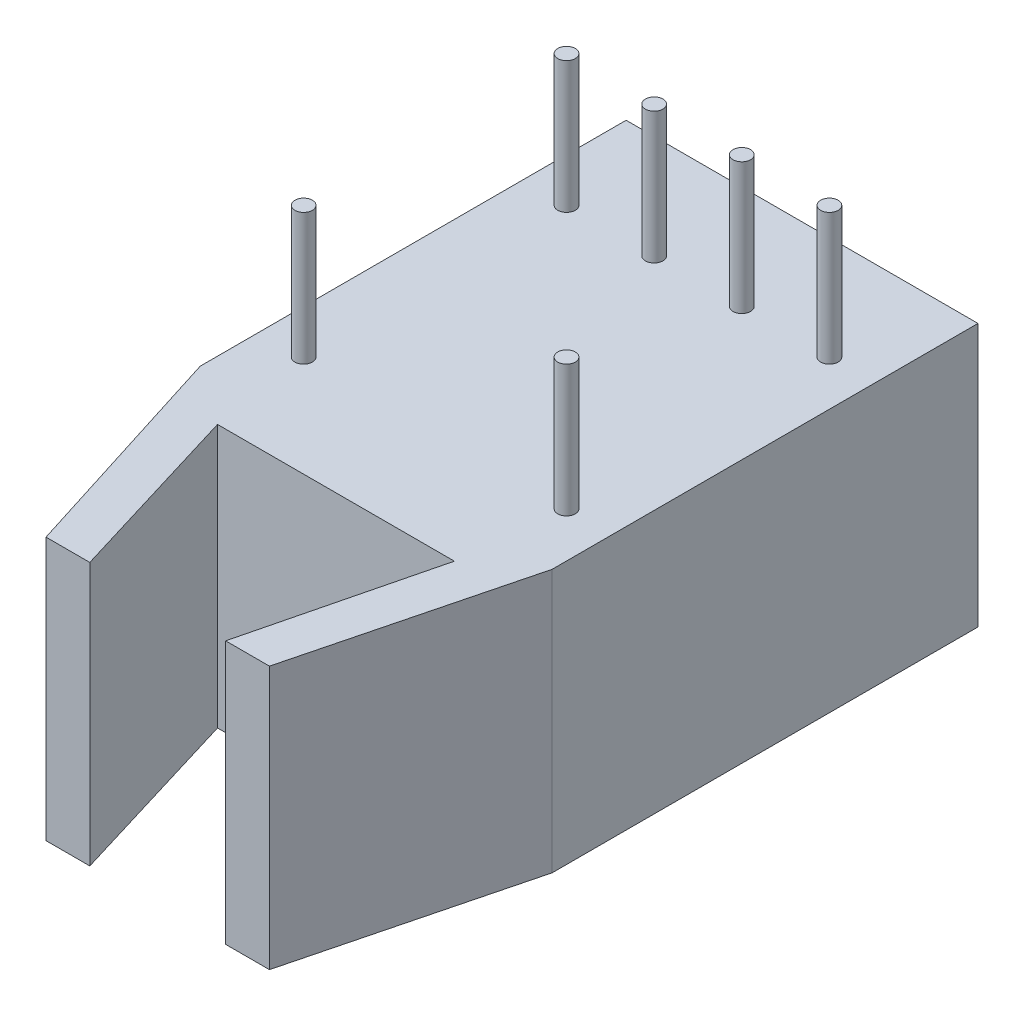
ISO-10303-21;
HEADER;
FILE_DESCRIPTION(('STEP AP214'),'2;1');
FILE_NAME('part.step','',(''),(''),'','','');
FILE_SCHEMA(('AUTOMOTIVE_DESIGN { 1 0 10303 214 1 1 1 1 }'));
ENDSEC;
DATA;
#1=APPLICATION_CONTEXT('core data for automotive mechanical design processes');
#2=APPLICATION_PROTOCOL_DEFINITION('international standard','automotive_design',2000,#1);
#3=PRODUCT_CONTEXT('',#1,'mechanical');
#4=PRODUCT('Part','Part','',(#3));
#5=PRODUCT_RELATED_PRODUCT_CATEGORY('part','',(#4));
#6=PRODUCT_DEFINITION_FORMATION('','',#4);
#7=PRODUCT_DEFINITION_CONTEXT('part definition',#1,'design');
#8=PRODUCT_DEFINITION('design','',#6,#7);
#9=PRODUCT_DEFINITION_SHAPE('','',#8);
#10=(LENGTH_UNIT() NAMED_UNIT(*) SI_UNIT(.MILLI.,.METRE.));
#11=(NAMED_UNIT(*) PLANE_ANGLE_UNIT() SI_UNIT($,.RADIAN.));
#12=(NAMED_UNIT(*) SI_UNIT($,.STERADIAN.) SOLID_ANGLE_UNIT());
#13=UNCERTAINTY_MEASURE_WITH_UNIT(LENGTH_MEASURE(1.E-05),#10,'distance_accuracy_value','');
#14=(GEOMETRIC_REPRESENTATION_CONTEXT(3) GLOBAL_UNCERTAINTY_ASSIGNED_CONTEXT((#13)) GLOBAL_UNIT_ASSIGNED_CONTEXT((#10,
#11,#12)) REPRESENTATION_CONTEXT('',''));
#15=CARTESIAN_POINT('',(0.,0.,0.));
#16=DIRECTION('',(0.,0.,1.));
#17=DIRECTION('',(1.,0.,0.));
#18=AXIS2_PLACEMENT_3D('',#15,#16,#17);
#19=CARTESIAN_POINT('',(0.,7.62,0.));
#20=DIRECTION('',(0.,1.,0.));
#21=DIRECTION('',(0.,0.,1.));
#22=AXIS2_PLACEMENT_3D('',#19,#20,#21);
#23=PLANE('',#22);
#24=CARTESIAN_POINT('',(1.27,7.62,2.9972));
#25=DIRECTION('',(0.,1.,0.));
#26=DIRECTION('',(0.,0.,1.));
#27=AXIS2_PLACEMENT_3D('',#24,#25,#26);
#28=CIRCLE('',#27,0.254);
#29=CARTESIAN_POINT('',(1.27,7.62,3.2512));
#30=VERTEX_POINT('',#29);
#31=EDGE_CURVE('E130',#30,#30,#28,.T.);
#32=ORIENTED_EDGE('',*,*,#31,.F.);
#33=EDGE_LOOP('',(#32));
#34=FACE_BOUND('',#33,.T.);
#35=DIRECTION('',(0.,0.,1.));
#36=VECTOR('',#35,1.);
#37=CARTESIAN_POINT('',(0.,7.62,0.));
#38=LINE('',#37,#36);
#39=CARTESIAN_POINT('',(0.,7.62,0.));
#40=VERTEX_POINT('',#39);
#41=CARTESIAN_POINT('',(0.,7.62,12.3444));
#42=VERTEX_POINT('',#41);
#43=EDGE_CURVE('E125',#40,#42,#38,.T.);
#44=ORIENTED_EDGE('',*,*,#43,.T.);
#45=DIRECTION('',(0.300509046787398,0.,0.953778964330274));
#46=VECTOR('',#45,1.);
#47=CARTESIAN_POINT('',(0.,7.62,12.3444));
#48=LINE('',#47,#46);
#49=CARTESIAN_POINT('',(2.05672700801933,7.62,18.8722));
#50=VERTEX_POINT('',#49);
#51=EDGE_CURVE('E107',#42,#50,#48,.T.);
#52=ORIENTED_EDGE('',*,*,#51,.T.);
#53=DIRECTION('',(1.,0.,0.));
#54=VECTOR('',#53,1.);
#55=CARTESIAN_POINT('',(2.05672700801933,7.62,18.8722));
#56=LINE('',#55,#54);
#57=CARTESIAN_POINT('',(3.32672700801933,7.62,18.8722));
#58=VERTEX_POINT('',#57);
#59=EDGE_CURVE('E117',#50,#58,#56,.T.);
#60=ORIENTED_EDGE('',*,*,#59,.T.);
#61=DIRECTION('',(-0.290411816615932,0.,-0.95690175920511));
#62=VECTOR('',#61,1.);
#63=CARTESIAN_POINT('',(3.32672700801933,7.62,18.8722));
#64=LINE('',#63,#62);
#65=CARTESIAN_POINT('',(1.71375929008197,7.62,13.5575001202891));
#66=VERTEX_POINT('',#65);
#67=EDGE_CURVE('E121',#58,#66,#64,.T.);
#68=ORIENTED_EDGE('',*,*,#67,.T.);
#69=DIRECTION('',(1.,0.,0.));
#70=VECTOR('',#69,1.);
#71=CARTESIAN_POINT('',(1.71375929008197,7.62,13.5575001202891));
#72=LINE('',#71,#70);
#73=CARTESIAN_POINT('',(8.57962491547872,7.62,13.5575001202891));
#74=VERTEX_POINT('',#73);
#75=EDGE_CURVE('E135',#66,#74,#72,.T.);
#76=ORIENTED_EDGE('',*,*,#75,.T.);
#77=DIRECTION('',(-0.240338643663703,0.,0.970689103864822));
#78=VECTOR('',#77,1.);
#79=CARTESIAN_POINT('',(8.57962491547872,7.62,13.5575001202891));
#80=LINE('',#79,#78);
#81=CARTESIAN_POINT('',(7.26372700801933,7.62,18.8722));
#82=VERTEX_POINT('',#81);
#83=EDGE_CURVE('E138',#74,#82,#80,.T.);
#84=ORIENTED_EDGE('',*,*,#83,.T.);
#85=DIRECTION('',(1.,0.,0.));
#86=VECTOR('',#85,1.);
#87=CARTESIAN_POINT('',(7.26372700801933,7.62,18.8722));
#88=LINE('',#87,#86);
#89=CARTESIAN_POINT('',(8.53372700801933,7.62,18.8722));
#90=VERTEX_POINT('',#89);
#91=EDGE_CURVE('E141',#82,#90,#88,.T.);
#92=ORIENTED_EDGE('',*,*,#91,.T.);
#93=DIRECTION('',(0.247327596518511,0.,-0.968931917113053));
#94=VECTOR('',#93,1.);
#95=CARTESIAN_POINT('',(8.53372700801933,7.62,18.8722));
#96=LINE('',#95,#94);
#97=CARTESIAN_POINT('',(10.2,7.62,12.3444));
#98=VERTEX_POINT('',#97);
#99=EDGE_CURVE('E144',#90,#98,#96,.T.);
#100=ORIENTED_EDGE('',*,*,#99,.T.);
#101=DIRECTION('',(0.,0.,-1.));
#102=VECTOR('',#101,1.);
#103=CARTESIAN_POINT('',(10.2,7.62,0.));
#104=LINE('',#103,#102);
#105=CARTESIAN_POINT('',(10.2,7.62,0.));
#106=VERTEX_POINT('',#105);
#107=EDGE_CURVE('E46',#98,#106,#104,.T.);
#108=ORIENTED_EDGE('',*,*,#107,.T.);
#109=DIRECTION('',(-1.,0.,0.));
#110=VECTOR('',#109,1.);
#111=CARTESIAN_POINT('',(0.,7.62,0.));
#112=LINE('',#111,#110);
#113=EDGE_CURVE('E41',#106,#40,#112,.T.);
#114=ORIENTED_EDGE('',*,*,#113,.T.);
#115=EDGE_LOOP('',(#44,#52,#60,#68,#76,#84,#92,#100,#108,#114));
#116=FACE_BOUND('',#115,.T.);
#117=CARTESIAN_POINT('',(3.81,7.62,2.9972));
#118=DIRECTION('',(0.,1.,0.));
#119=DIRECTION('',(0.,0.,1.));
#120=AXIS2_PLACEMENT_3D('',#117,#118,#119);
#121=CIRCLE('',#120,0.254);
#122=CARTESIAN_POINT('',(3.81,7.62,3.2512));
#123=VERTEX_POINT('',#122);
#124=EDGE_CURVE('E420',#123,#123,#121,.T.);
#125=ORIENTED_EDGE('',*,*,#124,.F.);
#126=EDGE_LOOP('',(#125));
#127=FACE_BOUND('',#126,.T.);
#128=CARTESIAN_POINT('',(6.35,7.62,2.9972));
#129=DIRECTION('',(0.,1.,0.));
#130=DIRECTION('',(0.,0.,1.));
#131=AXIS2_PLACEMENT_3D('',#128,#129,#130);
#132=CIRCLE('',#131,0.254);
#133=CARTESIAN_POINT('',(6.35,7.62,3.2512));
#134=VERTEX_POINT('',#133);
#135=EDGE_CURVE('E191',#134,#134,#132,.T.);
#136=ORIENTED_EDGE('',*,*,#135,.F.);
#137=EDGE_LOOP('',(#136));
#138=FACE_BOUND('',#137,.T.);
#139=CARTESIAN_POINT('',(8.89,7.62,2.9972));
#140=DIRECTION('',(0.,1.,0.));
#141=DIRECTION('',(0.,0.,1.));
#142=AXIS2_PLACEMENT_3D('',#139,#140,#141);
#143=CIRCLE('',#142,0.254);
#144=CARTESIAN_POINT('',(8.89,7.62,3.2512));
#145=VERTEX_POINT('',#144);
#146=EDGE_CURVE('E197',#145,#145,#143,.T.);
#147=ORIENTED_EDGE('',*,*,#146,.F.);
#148=EDGE_LOOP('',(#147));
#149=FACE_BOUND('',#148,.T.);
#150=CARTESIAN_POINT('',(1.27,7.62,10.6172));
#151=DIRECTION('',(0.,1.,0.));
#152=DIRECTION('',(0.,0.,1.));
#153=AXIS2_PLACEMENT_3D('',#150,#151,#152);
#154=CIRCLE('',#153,0.254);
#155=CARTESIAN_POINT('',(1.27,7.62,10.8712));
#156=VERTEX_POINT('',#155);
#157=EDGE_CURVE('E203',#156,#156,#154,.T.);
#158=ORIENTED_EDGE('',*,*,#157,.F.);
#159=EDGE_LOOP('',(#158));
#160=FACE_BOUND('',#159,.T.);
#161=CARTESIAN_POINT('',(8.89,7.62,10.6172));
#162=DIRECTION('',(0.,1.,0.));
#163=DIRECTION('',(0.,0.,1.));
#164=AXIS2_PLACEMENT_3D('',#161,#162,#163);
#165=CIRCLE('',#164,0.254);
#166=CARTESIAN_POINT('',(8.89,7.62,10.8712));
#167=VERTEX_POINT('',#166);
#168=EDGE_CURVE('E34',#167,#167,#165,.T.);
#169=ORIENTED_EDGE('',*,*,#168,.F.);
#170=EDGE_LOOP('',(#169));
#171=FACE_BOUND('',#170,.T.);
#172=ADVANCED_FACE('F26',(#34,#116,#127,#138,#149,#160,#171),#23,.T.);
#173=CARTESIAN_POINT('',(0.,7.62,0.));
#174=DIRECTION('',(1.,0.,0.));
#175=DIRECTION('',(0.,0.,-1.));
#176=AXIS2_PLACEMENT_3D('',#173,#174,#175);
#177=PLANE('',#176);
#178=DIRECTION('',(0.,0.,1.));
#179=VECTOR('',#178,1.);
#180=CARTESIAN_POINT('',(0.,0.,0.));
#181=LINE('',#180,#179);
#182=CARTESIAN_POINT('',(0.,0.,0.));
#183=VERTEX_POINT('',#182);
#184=CARTESIAN_POINT('',(0.,0.,12.3444));
#185=VERTEX_POINT('',#184);
#186=EDGE_CURVE('E165',#183,#185,#181,.T.);
#187=ORIENTED_EDGE('',*,*,#186,.T.);
#188=DIRECTION('',(0.,-1.,0.));
#189=VECTOR('',#188,1.);
#190=CARTESIAN_POINT('',(0.,7.62,12.3444));
#191=LINE('',#190,#189);
#192=EDGE_CURVE('E189',#42,#185,#191,.T.);
#193=ORIENTED_EDGE('',*,*,#192,.F.);
#194=ORIENTED_EDGE('',*,*,#43,.F.);
#195=DIRECTION('',(0.,-1.,0.));
#196=VECTOR('',#195,1.);
#197=CARTESIAN_POINT('',(0.,7.62,0.));
#198=LINE('',#197,#196);
#199=EDGE_CURVE('E181',#40,#183,#198,.T.);
#200=ORIENTED_EDGE('',*,*,#199,.T.);
#201=EDGE_LOOP('',(#187,#193,#194,#200));
#202=FACE_BOUND('',#201,.T.);
#203=ADVANCED_FACE('F214',(#202),#177,.F.);
#204=CARTESIAN_POINT('',(10.2,7.62,0.));
#205=DIRECTION('',(-1.,0.,0.));
#206=DIRECTION('',(0.,0.,1.));
#207=AXIS2_PLACEMENT_3D('',#204,#205,#206);
#208=PLANE('',#207);
#209=DIRECTION('',(0.,0.,-1.));
#210=VECTOR('',#209,1.);
#211=CARTESIAN_POINT('',(10.2,0.,0.));
#212=LINE('',#211,#210);
#213=CARTESIAN_POINT('',(10.2,0.,12.3444));
#214=VERTEX_POINT('',#213);
#215=CARTESIAN_POINT('',(10.2,0.,0.));
#216=VERTEX_POINT('',#215);
#217=EDGE_CURVE('E174',#214,#216,#212,.T.);
#218=ORIENTED_EDGE('',*,*,#217,.T.);
#219=DIRECTION('',(0.,-1.,0.));
#220=VECTOR('',#219,1.);
#221=CARTESIAN_POINT('',(10.2,7.62,0.));
#222=LINE('',#221,#220);
#223=EDGE_CURVE('E184',#106,#216,#222,.T.);
#224=ORIENTED_EDGE('',*,*,#223,.F.);
#225=ORIENTED_EDGE('',*,*,#107,.F.);
#226=DIRECTION('',(0.,-1.,0.));
#227=VECTOR('',#226,1.);
#228=CARTESIAN_POINT('',(10.2,7.62,12.3444));
#229=LINE('',#228,#227);
#230=EDGE_CURVE('E187',#98,#214,#229,.T.);
#231=ORIENTED_EDGE('',*,*,#230,.T.);
#232=EDGE_LOOP('',(#218,#224,#225,#231));
#233=FACE_BOUND('',#232,.T.);
#234=ADVANCED_FACE('F222',(#233),#208,.F.);
#235=CARTESIAN_POINT('',(0.,7.62,0.));
#236=DIRECTION('',(0.,0.,1.));
#237=DIRECTION('',(1.,0.,0.));
#238=AXIS2_PLACEMENT_3D('',#235,#236,#237);
#239=PLANE('',#238);
#240=DIRECTION('',(-1.,0.,0.));
#241=VECTOR('',#240,1.);
#242=CARTESIAN_POINT('',(0.,0.,0.));
#243=LINE('',#242,#241);
#244=EDGE_CURVE('E176',#216,#183,#243,.T.);
#245=ORIENTED_EDGE('',*,*,#244,.T.);
#246=ORIENTED_EDGE('',*,*,#199,.F.);
#247=ORIENTED_EDGE('',*,*,#113,.F.);
#248=ORIENTED_EDGE('',*,*,#223,.T.);
#249=EDGE_LOOP('',(#245,#246,#247,#248));
#250=FACE_BOUND('',#249,.T.);
#251=ADVANCED_FACE('F230',(#250),#239,.F.);
#252=CARTESIAN_POINT('',(0.,0.,0.));
#253=DIRECTION('',(0.,1.,0.));
#254=DIRECTION('',(0.,0.,1.));
#255=AXIS2_PLACEMENT_3D('',#252,#253,#254);
#256=PLANE('',#255);
#257=ORIENTED_EDGE('',*,*,#186,.F.);
#258=ORIENTED_EDGE('',*,*,#244,.F.);
#259=ORIENTED_EDGE('',*,*,#217,.F.);
#260=DIRECTION('',(0.247327596518511,0.,-0.968931917113053));
#261=VECTOR('',#260,1.);
#262=CARTESIAN_POINT('',(8.53372700801933,0.,18.8722));
#263=LINE('',#262,#261);
#264=CARTESIAN_POINT('',(8.53372700801933,0.,18.8722));
#265=VERTEX_POINT('',#264);
#266=EDGE_CURVE('E114',#265,#214,#263,.T.);
#267=ORIENTED_EDGE('',*,*,#266,.F.);
#268=DIRECTION('',(1.,0.,0.));
#269=VECTOR('',#268,1.);
#270=CARTESIAN_POINT('',(7.26372700801933,0.,18.8722));
#271=LINE('',#270,#269);
#272=CARTESIAN_POINT('',(7.26372700801933,0.,18.8722));
#273=VERTEX_POINT('',#272);
#274=EDGE_CURVE('E158',#273,#265,#271,.T.);
#275=ORIENTED_EDGE('',*,*,#274,.F.);
#276=DIRECTION('',(-0.240338643663703,0.,0.970689103864822));
#277=VECTOR('',#276,1.);
#278=CARTESIAN_POINT('',(8.57962491547872,0.,13.5575001202891));
#279=LINE('',#278,#277);
#280=CARTESIAN_POINT('',(8.57962491547872,0.,13.5575001202891));
#281=VERTEX_POINT('',#280);
#282=EDGE_CURVE('E155',#281,#273,#279,.T.);
#283=ORIENTED_EDGE('',*,*,#282,.F.);
#284=DIRECTION('',(1.,0.,0.));
#285=VECTOR('',#284,1.);
#286=CARTESIAN_POINT('',(1.71375929008197,0.,13.5575001202891));
#287=LINE('',#286,#285);
#288=CARTESIAN_POINT('',(1.71375929008197,0.,13.5575001202891));
#289=VERTEX_POINT('',#288);
#290=EDGE_CURVE('E152',#289,#281,#287,.T.);
#291=ORIENTED_EDGE('',*,*,#290,.F.);
#292=DIRECTION('',(-0.290411816615932,0.,-0.95690175920511));
#293=VECTOR('',#292,1.);
#294=CARTESIAN_POINT('',(3.32672700801933,0.,18.8722));
#295=LINE('',#294,#293);
#296=CARTESIAN_POINT('',(3.32672700801933,0.,18.8722));
#297=VERTEX_POINT('',#296);
#298=EDGE_CURVE('E149',#297,#289,#295,.T.);
#299=ORIENTED_EDGE('',*,*,#298,.F.);
#300=DIRECTION('',(1.,0.,0.));
#301=VECTOR('',#300,1.);
#302=CARTESIAN_POINT('',(2.05672700801933,0.,18.8722));
#303=LINE('',#302,#301);
#304=CARTESIAN_POINT('',(2.05672700801933,0.,18.8722));
#305=VERTEX_POINT('',#304);
#306=EDGE_CURVE('E147',#305,#297,#303,.T.);
#307=ORIENTED_EDGE('',*,*,#306,.F.);
#308=DIRECTION('',(0.300509046787398,0.,0.953778964330274));
#309=VECTOR('',#308,1.);
#310=CARTESIAN_POINT('',(0.,0.,12.3444));
#311=LINE('',#310,#309);
#312=EDGE_CURVE('E109',#185,#305,#311,.T.);
#313=ORIENTED_EDGE('',*,*,#312,.F.);
#314=EDGE_LOOP('',(#257,#258,#259,#267,#275,#283,#291,#299,#307,#313));
#315=FACE_BOUND('',#314,.T.);
#316=ADVANCED_FACE('F228',(#315),#256,.F.);
#317=CARTESIAN_POINT('',(8.53372700801933,0.,18.8722));
#318=DIRECTION('',(0.968931917113053,0.,0.247327596518511));
#319=DIRECTION('',(0.247327596518511,0.,-0.968931917113053));
#320=AXIS2_PLACEMENT_3D('',#317,#318,#319);
#321=PLANE('',#320);
#322=ORIENTED_EDGE('',*,*,#99,.F.);
#323=DIRECTION('',(0.,1.,0.));
#324=VECTOR('',#323,1.);
#325=CARTESIAN_POINT('',(8.53372700801933,0.,18.8722));
#326=LINE('',#325,#324);
#327=EDGE_CURVE('E163',#265,#90,#326,.T.);
#328=ORIENTED_EDGE('',*,*,#327,.F.);
#329=ORIENTED_EDGE('',*,*,#266,.T.);
#330=ORIENTED_EDGE('',*,*,#230,.F.);
#331=EDGE_LOOP('',(#322,#328,#329,#330));
#332=FACE_BOUND('',#331,.T.);
#333=ADVANCED_FACE('F371',(#332),#321,.T.);
#334=CARTESIAN_POINT('',(7.26372700801933,0.,18.8722));
#335=DIRECTION('',(0.,0.,1.));
#336=DIRECTION('',(1.,0.,0.));
#337=AXIS2_PLACEMENT_3D('',#334,#335,#336);
#338=PLANE('',#337);
#339=ORIENTED_EDGE('',*,*,#91,.F.);
#340=DIRECTION('',(0.,1.,0.));
#341=VECTOR('',#340,1.);
#342=CARTESIAN_POINT('',(7.26372700801933,0.,18.8722));
#343=LINE('',#342,#341);
#344=EDGE_CURVE('E166',#273,#82,#343,.T.);
#345=ORIENTED_EDGE('',*,*,#344,.F.);
#346=ORIENTED_EDGE('',*,*,#274,.T.);
#347=ORIENTED_EDGE('',*,*,#327,.T.);
#348=EDGE_LOOP('',(#339,#345,#346,#347));
#349=FACE_BOUND('',#348,.T.);
#350=ADVANCED_FACE('F363',(#349),#338,.T.);
#351=CARTESIAN_POINT('',(8.57962491547872,0.,13.5575001202891));
#352=DIRECTION('',(-0.970689103864822,0.,-0.240338643663703));
#353=DIRECTION('',(-0.240338643663703,0.,0.970689103864822));
#354=AXIS2_PLACEMENT_3D('',#351,#352,#353);
#355=PLANE('',#354);
#356=ORIENTED_EDGE('',*,*,#83,.F.);
#357=DIRECTION('',(0.,1.,0.));
#358=VECTOR('',#357,1.);
#359=CARTESIAN_POINT('',(8.57962491547872,0.,13.5575001202891));
#360=LINE('',#359,#358);
#361=EDGE_CURVE('E168',#281,#74,#360,.T.);
#362=ORIENTED_EDGE('',*,*,#361,.F.);
#363=ORIENTED_EDGE('',*,*,#282,.T.);
#364=ORIENTED_EDGE('',*,*,#344,.T.);
#365=EDGE_LOOP('',(#356,#362,#363,#364));
#366=FACE_BOUND('',#365,.T.);
#367=ADVANCED_FACE('F355',(#366),#355,.T.);
#368=CARTESIAN_POINT('',(1.71375929008197,0.,13.5575001202891));
#369=DIRECTION('',(0.,0.,1.));
#370=DIRECTION('',(1.,0.,0.));
#371=AXIS2_PLACEMENT_3D('',#368,#369,#370);
#372=PLANE('',#371);
#373=ORIENTED_EDGE('',*,*,#75,.F.);
#374=DIRECTION('',(0.,1.,0.));
#375=VECTOR('',#374,1.);
#376=CARTESIAN_POINT('',(1.71375929008197,0.,13.5575001202891));
#377=LINE('',#376,#375);
#378=EDGE_CURVE('E170',#289,#66,#377,.T.);
#379=ORIENTED_EDGE('',*,*,#378,.F.);
#380=ORIENTED_EDGE('',*,*,#290,.T.);
#381=ORIENTED_EDGE('',*,*,#361,.T.);
#382=EDGE_LOOP('',(#373,#379,#380,#381));
#383=FACE_BOUND('',#382,.T.);
#384=ADVANCED_FACE('F347',(#383),#372,.T.);
#385=CARTESIAN_POINT('',(3.32672700801933,0.,18.8722));
#386=DIRECTION('',(0.95690175920511,0.,-0.290411816615932));
#387=DIRECTION('',(-0.290411816615932,0.,-0.95690175920511));
#388=AXIS2_PLACEMENT_3D('',#385,#386,#387);
#389=PLANE('',#388);
#390=ORIENTED_EDGE('',*,*,#67,.F.);
#391=DIRECTION('',(0.,1.,0.));
#392=VECTOR('',#391,1.);
#393=CARTESIAN_POINT('',(3.32672700801933,0.,18.8722));
#394=LINE('',#393,#392);
#395=EDGE_CURVE('E113',#297,#58,#394,.T.);
#396=ORIENTED_EDGE('',*,*,#395,.F.);
#397=ORIENTED_EDGE('',*,*,#298,.T.);
#398=ORIENTED_EDGE('',*,*,#378,.T.);
#399=EDGE_LOOP('',(#390,#396,#397,#398));
#400=FACE_BOUND('',#399,.T.);
#401=ADVANCED_FACE('F340',(#400),#389,.T.);
#402=CARTESIAN_POINT('',(2.05672700801933,0.,18.8722));
#403=DIRECTION('',(0.,0.,1.));
#404=DIRECTION('',(1.,0.,0.));
#405=AXIS2_PLACEMENT_3D('',#402,#403,#404);
#406=PLANE('',#405);
#407=ORIENTED_EDGE('',*,*,#59,.F.);
#408=DIRECTION('',(0.,1.,0.));
#409=VECTOR('',#408,1.);
#410=CARTESIAN_POINT('',(2.05672700801933,0.,18.8722));
#411=LINE('',#410,#409);
#412=EDGE_CURVE('E102',#305,#50,#411,.T.);
#413=ORIENTED_EDGE('',*,*,#412,.F.);
#414=ORIENTED_EDGE('',*,*,#306,.T.);
#415=ORIENTED_EDGE('',*,*,#395,.T.);
#416=EDGE_LOOP('',(#407,#413,#414,#415));
#417=FACE_BOUND('',#416,.T.);
#418=ADVANCED_FACE('F118',(#417),#406,.T.);
#419=CARTESIAN_POINT('',(0.,0.,12.3444));
#420=DIRECTION('',(-0.953778964330274,0.,0.300509046787398));
#421=DIRECTION('',(0.300509046787398,0.,0.953778964330274));
#422=AXIS2_PLACEMENT_3D('',#419,#420,#421);
#423=PLANE('',#422);
#424=ORIENTED_EDGE('',*,*,#51,.F.);
#425=ORIENTED_EDGE('',*,*,#192,.T.);
#426=ORIENTED_EDGE('',*,*,#312,.T.);
#427=ORIENTED_EDGE('',*,*,#412,.T.);
#428=EDGE_LOOP('',(#424,#425,#426,#427));
#429=FACE_BOUND('',#428,.T.);
#430=ADVANCED_FACE('F104',(#429),#423,.T.);
#431=CARTESIAN_POINT('',(1.27,11.43,2.9972));
#432=DIRECTION('',(0.,-1.,0.));
#433=DIRECTION('',(0.,0.,-1.));
#434=AXIS2_PLACEMENT_3D('',#431,#432,#433);
#435=CYLINDRICAL_SURFACE('',#434,0.254);
#436=CARTESIAN_POINT('',(1.27,11.43,2.9972));
#437=DIRECTION('',(0.,1.,0.));
#438=DIRECTION('',(0.,0.,1.));
#439=AXIS2_PLACEMENT_3D('',#436,#437,#438);
#440=CIRCLE('',#439,0.254);
#441=CARTESIAN_POINT('',(1.27,11.43,3.2512));
#442=VERTEX_POINT('',#441);
#443=EDGE_CURVE('E127',#442,#442,#440,.T.);
#444=ORIENTED_EDGE('',*,*,#443,.F.);
#445=EDGE_LOOP('',(#444));
#446=FACE_BOUND('',#445,.T.);
#447=ORIENTED_EDGE('',*,*,#31,.T.);
#448=EDGE_LOOP('',(#447));
#449=FACE_BOUND('',#448,.T.);
#450=ADVANCED_FACE('F320',(#446,#449),#435,.T.);
#451=CARTESIAN_POINT('',(1.27,11.43,2.9972));
#452=DIRECTION('',(0.,1.,0.));
#453=DIRECTION('',(0.,0.,1.));
#454=AXIS2_PLACEMENT_3D('',#451,#452,#453);
#455=PLANE('',#454);
#456=ORIENTED_EDGE('',*,*,#443,.T.);
#457=EDGE_LOOP('',(#456));
#458=FACE_BOUND('',#457,.T.);
#459=ADVANCED_FACE('F302',(#458),#455,.T.);
#460=CARTESIAN_POINT('',(3.81,11.43,2.9972));
#461=DIRECTION('',(0.,-1.,0.));
#462=DIRECTION('',(0.,0.,-1.));
#463=AXIS2_PLACEMENT_3D('',#460,#461,#462);
#464=CYLINDRICAL_SURFACE('',#463,0.254);
#465=CARTESIAN_POINT('',(3.81,11.43,2.9972));
#466=DIRECTION('',(0.,1.,0.));
#467=DIRECTION('',(0.,0.,1.));
#468=AXIS2_PLACEMENT_3D('',#465,#466,#467);
#469=CIRCLE('',#468,0.254);
#470=CARTESIAN_POINT('',(3.81,11.43,3.2512));
#471=VERTEX_POINT('',#470);
#472=EDGE_CURVE('E418',#471,#471,#469,.T.);
#473=ORIENTED_EDGE('',*,*,#472,.F.);
#474=EDGE_LOOP('',(#473));
#475=FACE_BOUND('',#474,.T.);
#476=ORIENTED_EDGE('',*,*,#124,.T.);
#477=EDGE_LOOP('',(#476));
#478=FACE_BOUND('',#477,.T.);
#479=ADVANCED_FACE('F247',(#475,#478),#464,.T.);
#480=CARTESIAN_POINT('',(3.81,11.43,2.9972));
#481=DIRECTION('',(0.,1.,0.));
#482=DIRECTION('',(0.,0.,1.));
#483=AXIS2_PLACEMENT_3D('',#480,#481,#482);
#484=PLANE('',#483);
#485=ORIENTED_EDGE('',*,*,#472,.T.);
#486=EDGE_LOOP('',(#485));
#487=FACE_BOUND('',#486,.T.);
#488=ADVANCED_FACE('F245',(#487),#484,.T.);
#489=CARTESIAN_POINT('',(6.35,11.43,2.9972));
#490=DIRECTION('',(0.,1.,0.));
#491=DIRECTION('',(0.,0.,1.));
#492=AXIS2_PLACEMENT_3D('',#489,#490,#491);
#493=PLANE('',#492);
#494=CARTESIAN_POINT('',(6.35,11.43,2.9972));
#495=DIRECTION('',(0.,1.,0.));
#496=DIRECTION('',(0.,0.,1.));
#497=AXIS2_PLACEMENT_3D('',#494,#495,#496);
#498=CIRCLE('',#497,0.254);
#499=CARTESIAN_POINT('',(6.35,11.43,3.2512));
#500=VERTEX_POINT('',#499);
#501=EDGE_CURVE('E194',#500,#500,#498,.T.);
#502=ORIENTED_EDGE('',*,*,#501,.T.);
#503=EDGE_LOOP('',(#502));
#504=FACE_BOUND('',#503,.T.);
#505=ADVANCED_FACE('F241',(#504),#493,.T.);
#506=CARTESIAN_POINT('',(6.35,11.43,2.9972));
#507=DIRECTION('',(0.,-1.,0.));
#508=DIRECTION('',(0.,0.,-1.));
#509=AXIS2_PLACEMENT_3D('',#506,#507,#508);
#510=CYLINDRICAL_SURFACE('',#509,0.254);
#511=ORIENTED_EDGE('',*,*,#501,.F.);
#512=EDGE_LOOP('',(#511));
#513=FACE_BOUND('',#512,.T.);
#514=ORIENTED_EDGE('',*,*,#135,.T.);
#515=EDGE_LOOP('',(#514));
#516=FACE_BOUND('',#515,.T.);
#517=ADVANCED_FACE('F237',(#513,#516),#510,.T.);
#518=CARTESIAN_POINT('',(8.89,11.43,2.9972));
#519=DIRECTION('',(0.,1.,0.));
#520=DIRECTION('',(0.,0.,1.));
#521=AXIS2_PLACEMENT_3D('',#518,#519,#520);
#522=PLANE('',#521);
#523=CARTESIAN_POINT('',(8.89,11.43,2.9972));
#524=DIRECTION('',(0.,1.,0.));
#525=DIRECTION('',(0.,0.,1.));
#526=AXIS2_PLACEMENT_3D('',#523,#524,#525);
#527=CIRCLE('',#526,0.254);
#528=CARTESIAN_POINT('',(8.89,11.43,3.2512));
#529=VERTEX_POINT('',#528);
#530=EDGE_CURVE('E200',#529,#529,#527,.T.);
#531=ORIENTED_EDGE('',*,*,#530,.T.);
#532=EDGE_LOOP('',(#531));
#533=FACE_BOUND('',#532,.T.);
#534=ADVANCED_FACE('F240',(#533),#522,.T.);
#535=CARTESIAN_POINT('',(8.89,11.43,2.9972));
#536=DIRECTION('',(0.,-1.,0.));
#537=DIRECTION('',(0.,0.,-1.));
#538=AXIS2_PLACEMENT_3D('',#535,#536,#537);
#539=CYLINDRICAL_SURFACE('',#538,0.254);
#540=ORIENTED_EDGE('',*,*,#530,.F.);
#541=EDGE_LOOP('',(#540));
#542=FACE_BOUND('',#541,.T.);
#543=ORIENTED_EDGE('',*,*,#146,.T.);
#544=EDGE_LOOP('',(#543));
#545=FACE_BOUND('',#544,.T.);
#546=ADVANCED_FACE('F248',(#542,#545),#539,.T.);
#547=CARTESIAN_POINT('',(1.27,11.43,10.6172));
#548=DIRECTION('',(0.,1.,0.));
#549=DIRECTION('',(0.,0.,1.));
#550=AXIS2_PLACEMENT_3D('',#547,#548,#549);
#551=PLANE('',#550);
#552=CARTESIAN_POINT('',(1.27,11.43,10.6172));
#553=DIRECTION('',(0.,1.,0.));
#554=DIRECTION('',(0.,0.,1.));
#555=AXIS2_PLACEMENT_3D('',#552,#553,#554);
#556=CIRCLE('',#555,0.254);
#557=CARTESIAN_POINT('',(1.27,11.43,10.8712));
#558=VERTEX_POINT('',#557);
#559=EDGE_CURVE('E206',#558,#558,#556,.T.);
#560=ORIENTED_EDGE('',*,*,#559,.T.);
#561=EDGE_LOOP('',(#560));
#562=FACE_BOUND('',#561,.T.);
#563=ADVANCED_FACE('F251',(#562),#551,.T.);
#564=CARTESIAN_POINT('',(1.27,11.43,10.6172));
#565=DIRECTION('',(0.,-1.,0.));
#566=DIRECTION('',(0.,0.,-1.));
#567=AXIS2_PLACEMENT_3D('',#564,#565,#566);
#568=CYLINDRICAL_SURFACE('',#567,0.254);
#569=ORIENTED_EDGE('',*,*,#559,.F.);
#570=EDGE_LOOP('',(#569));
#571=FACE_BOUND('',#570,.T.);
#572=ORIENTED_EDGE('',*,*,#157,.T.);
#573=EDGE_LOOP('',(#572));
#574=FACE_BOUND('',#573,.T.);
#575=ADVANCED_FACE('F256',(#571,#574),#568,.T.);
#576=CARTESIAN_POINT('',(8.89,11.43,10.6172));
#577=DIRECTION('',(0.,1.,0.));
#578=DIRECTION('',(0.,0.,1.));
#579=AXIS2_PLACEMENT_3D('',#576,#577,#578);
#580=PLANE('',#579);
#581=CARTESIAN_POINT('',(8.89,11.43,10.6172));
#582=DIRECTION('',(0.,1.,0.));
#583=DIRECTION('',(0.,0.,1.));
#584=AXIS2_PLACEMENT_3D('',#581,#582,#583);
#585=CIRCLE('',#584,0.254);
#586=CARTESIAN_POINT('',(8.89,11.43,10.8712));
#587=VERTEX_POINT('',#586);
#588=EDGE_CURVE('E11',#587,#587,#585,.T.);
#589=ORIENTED_EDGE('',*,*,#588,.T.);
#590=EDGE_LOOP('',(#589));
#591=FACE_BOUND('',#590,.T.);
#592=ADVANCED_FACE('F28',(#591),#580,.T.);
#593=CARTESIAN_POINT('',(8.89,11.43,10.6172));
#594=DIRECTION('',(0.,-1.,0.));
#595=DIRECTION('',(0.,0.,-1.));
#596=AXIS2_PLACEMENT_3D('',#593,#594,#595);
#597=CYLINDRICAL_SURFACE('',#596,0.254);
#598=ORIENTED_EDGE('',*,*,#588,.F.);
#599=EDGE_LOOP('',(#598));
#600=FACE_BOUND('',#599,.T.);
#601=ORIENTED_EDGE('',*,*,#168,.T.);
#602=EDGE_LOOP('',(#601));
#603=FACE_BOUND('',#602,.T.);
#604=ADVANCED_FACE('F211',(#600,#603),#597,.T.);
#605=CLOSED_SHELL('',(#172,#203,#234,#251,#316,#333,#350,#367,#384,#401,#418,#430,#450,#459,
#479,#488,#505,#517,#534,#546,#563,#575,#592,#604));
#606=MANIFOLD_SOLID_BREP('B2',#605);
#607=ADVANCED_BREP_SHAPE_REPRESENTATION('',(#18,#606),#14);
#608=SHAPE_DEFINITION_REPRESENTATION(#9,#607);
ENDSEC;
END-ISO-10303-21;
